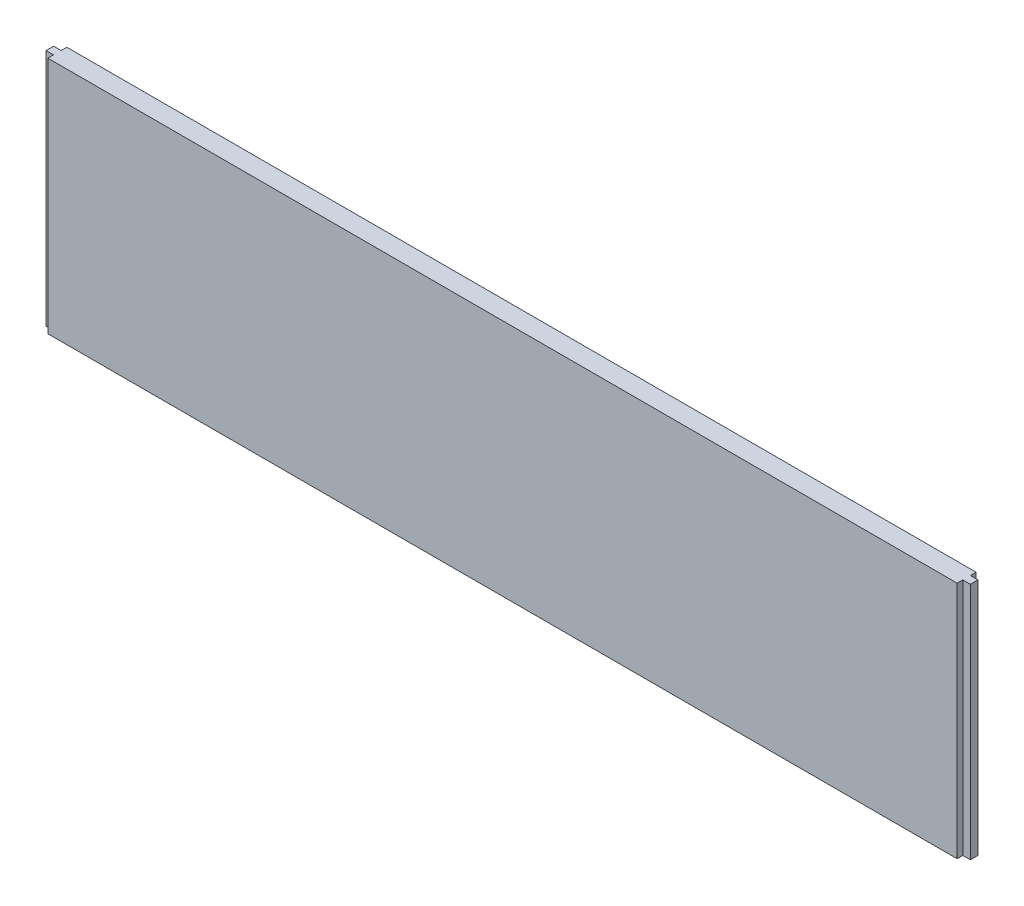
ISO-10303-21;
HEADER;
FILE_DESCRIPTION(('STEP AP214'),'2;1');
FILE_NAME('part.step','',(''),(''),'','','');
FILE_SCHEMA(('AUTOMOTIVE_DESIGN { 1 0 10303 214 1 1 1 1 }'));
ENDSEC;
DATA;
#1=APPLICATION_CONTEXT('core data for automotive mechanical design processes');
#2=APPLICATION_PROTOCOL_DEFINITION('international standard','automotive_design',2000,#1);
#3=PRODUCT_CONTEXT('',#1,'mechanical');
#4=PRODUCT('Part','Part','',(#3));
#5=PRODUCT_RELATED_PRODUCT_CATEGORY('part','',(#4));
#6=PRODUCT_DEFINITION_FORMATION('','',#4);
#7=PRODUCT_DEFINITION_CONTEXT('part definition',#1,'design');
#8=PRODUCT_DEFINITION('design','',#6,#7);
#9=PRODUCT_DEFINITION_SHAPE('','',#8);
#10=(LENGTH_UNIT() NAMED_UNIT(*) SI_UNIT(.MILLI.,.METRE.));
#11=(NAMED_UNIT(*) PLANE_ANGLE_UNIT() SI_UNIT($,.RADIAN.));
#12=(NAMED_UNIT(*) SI_UNIT($,.STERADIAN.) SOLID_ANGLE_UNIT());
#13=UNCERTAINTY_MEASURE_WITH_UNIT(LENGTH_MEASURE(1.E-05),#10,'distance_accuracy_value','');
#14=(GEOMETRIC_REPRESENTATION_CONTEXT(3) GLOBAL_UNCERTAINTY_ASSIGNED_CONTEXT((#13)) GLOBAL_UNIT_ASSIGNED_CONTEXT((#10,
#11,#12)) REPRESENTATION_CONTEXT('',''));
#15=CARTESIAN_POINT('',(0.,0.,0.));
#16=DIRECTION('',(0.,0.,1.));
#17=DIRECTION('',(1.,0.,0.));
#18=AXIS2_PLACEMENT_3D('',#15,#16,#17);
#19=CARTESIAN_POINT('',(0.,0.,15.875));
#20=DIRECTION('',(1.,0.,0.));
#21=DIRECTION('',(0.,0.,-1.));
#22=AXIS2_PLACEMENT_3D('',#19,#20,#21);
#23=PLANE('',#22);
#24=DIRECTION('',(0.,0.,-1.));
#25=VECTOR('',#24,1.);
#26=CARTESIAN_POINT('',(0.,0.,15.875));
#27=LINE('',#26,#25);
#28=CARTESIAN_POINT('',(0.,0.,11.1125));
#29=VERTEX_POINT('',#28);
#30=CARTESIAN_POINT('',(0.,0.,4.7625));
#31=VERTEX_POINT('',#30);
#32=EDGE_CURVE('E11',#29,#31,#27,.T.);
#33=ORIENTED_EDGE('',*,*,#32,.F.);
#34=DIRECTION('',(0.,1.,0.));
#35=VECTOR('',#34,1.);
#36=CARTESIAN_POINT('',(0.,0.,11.1125));
#37=LINE('',#36,#35);
#38=CARTESIAN_POINT('',(0.,200.025,11.1125));
#39=VERTEX_POINT('',#38);
#40=EDGE_CURVE('E125',#29,#39,#37,.T.);
#41=ORIENTED_EDGE('',*,*,#40,.T.);
#42=DIRECTION('',(0.,0.,-1.));
#43=VECTOR('',#42,1.);
#44=CARTESIAN_POINT('',(0.,200.025,15.875));
#45=LINE('',#44,#43);
#46=CARTESIAN_POINT('',(0.,200.025,4.7625));
#47=VERTEX_POINT('',#46);
#48=EDGE_CURVE('E204',#39,#47,#45,.T.);
#49=ORIENTED_EDGE('',*,*,#48,.T.);
#50=DIRECTION('',(0.,1.,0.));
#51=VECTOR('',#50,1.);
#52=CARTESIAN_POINT('',(0.,0.,4.7625));
#53=LINE('',#52,#51);
#54=EDGE_CURVE('E153',#31,#47,#53,.T.);
#55=ORIENTED_EDGE('',*,*,#54,.F.);
#56=EDGE_LOOP('',(#33,#41,#49,#55));
#57=FACE_BOUND('',#56,.T.);
#58=ADVANCED_FACE('F33',(#57),#23,.F.);
#59=CARTESIAN_POINT('',(0.,0.,15.875));
#60=DIRECTION('',(0.,1.,0.));
#61=DIRECTION('',(0.,0.,1.));
#62=AXIS2_PLACEMENT_3D('',#59,#60,#61);
#63=PLANE('',#62);
#64=DIRECTION('',(0.,0.,-1.));
#65=VECTOR('',#64,1.);
#66=CARTESIAN_POINT('',(6.34999999999997,0.,15.875));
#67=LINE('',#66,#65);
#68=CARTESIAN_POINT('',(6.34999999999997,0.,15.875));
#69=VERTEX_POINT('',#68);
#70=CARTESIAN_POINT('',(6.34999999999997,0.,11.1125));
#71=VERTEX_POINT('',#70);
#72=EDGE_CURVE('E47',#69,#71,#67,.T.);
#73=ORIENTED_EDGE('',*,*,#72,.T.);
#74=DIRECTION('',(-1.,0.,0.));
#75=VECTOR('',#74,1.);
#76=CARTESIAN_POINT('',(0.,0.,11.1125));
#77=LINE('',#76,#75);
#78=EDGE_CURVE('E129',#71,#29,#77,.T.);
#79=ORIENTED_EDGE('',*,*,#78,.T.);
#80=ORIENTED_EDGE('',*,*,#32,.T.);
#81=DIRECTION('',(1.,0.,0.));
#82=VECTOR('',#81,1.);
#83=CARTESIAN_POINT('',(0.,0.,4.7625));
#84=LINE('',#83,#82);
#85=CARTESIAN_POINT('',(6.34999999999997,0.,4.7625));
#86=VERTEX_POINT('',#85);
#87=EDGE_CURVE('E147',#31,#86,#84,.T.);
#88=ORIENTED_EDGE('',*,*,#87,.T.);
#89=DIRECTION('',(0.,0.,-1.));
#90=VECTOR('',#89,1.);
#91=CARTESIAN_POINT('',(6.34999999999986,0.,2.67147415300428E-12));
#92=LINE('',#91,#90);
#93=CARTESIAN_POINT('',(6.34999999999986,0.,2.67147415300428E-12));
#94=VERTEX_POINT('',#93);
#95=EDGE_CURVE('E150',#86,#94,#92,.T.);
#96=ORIENTED_EDGE('',*,*,#95,.T.);
#97=DIRECTION('',(1.,0.,0.));
#98=VECTOR('',#97,1.);
#99=CARTESIAN_POINT('',(0.,0.,0.));
#100=LINE('',#99,#98);
#101=CARTESIAN_POINT('',(768.35,0.,0.));
#102=VERTEX_POINT('',#101);
#103=EDGE_CURVE('E195',#94,#102,#100,.T.);
#104=ORIENTED_EDGE('',*,*,#103,.T.);
#105=DIRECTION('',(0.,0.,1.));
#106=VECTOR('',#105,1.);
#107=CARTESIAN_POINT('',(768.35,0.,0.));
#108=LINE('',#107,#106);
#109=CARTESIAN_POINT('',(768.35,0.,4.7625));
#110=VERTEX_POINT('',#109);
#111=EDGE_CURVE('E164',#102,#110,#108,.T.);
#112=ORIENTED_EDGE('',*,*,#111,.T.);
#113=DIRECTION('',(1.,0.,0.));
#114=VECTOR('',#113,1.);
#115=CARTESIAN_POINT('',(774.7,0.,4.7625));
#116=LINE('',#115,#114);
#117=CARTESIAN_POINT('',(774.7,0.,4.7625));
#118=VERTEX_POINT('',#117);
#119=EDGE_CURVE('E167',#110,#118,#116,.T.);
#120=ORIENTED_EDGE('',*,*,#119,.T.);
#121=DIRECTION('',(0.,0.,-1.));
#122=VECTOR('',#121,1.);
#123=CARTESIAN_POINT('',(774.7,0.,15.875));
#124=LINE('',#123,#122);
#125=CARTESIAN_POINT('',(774.7,0.,11.1125));
#126=VERTEX_POINT('',#125);
#127=EDGE_CURVE('E40',#126,#118,#124,.T.);
#128=ORIENTED_EDGE('',*,*,#127,.F.);
#129=DIRECTION('',(-1.,0.,0.));
#130=VECTOR('',#129,1.);
#131=CARTESIAN_POINT('',(774.7,0.,11.1125));
#132=LINE('',#131,#130);
#133=CARTESIAN_POINT('',(768.35,0.,11.1125));
#134=VERTEX_POINT('',#133);
#135=EDGE_CURVE('E182',#126,#134,#132,.T.);
#136=ORIENTED_EDGE('',*,*,#135,.T.);
#137=DIRECTION('',(0.,0.,1.));
#138=VECTOR('',#137,1.);
#139=CARTESIAN_POINT('',(768.35,0.,15.875));
#140=LINE('',#139,#138);
#141=CARTESIAN_POINT('',(768.35,0.,15.875));
#142=VERTEX_POINT('',#141);
#143=EDGE_CURVE('E185',#134,#142,#140,.T.);
#144=ORIENTED_EDGE('',*,*,#143,.T.);
#145=DIRECTION('',(1.,0.,0.));
#146=VECTOR('',#145,1.);
#147=CARTESIAN_POINT('',(0.,0.,15.875));
#148=LINE('',#147,#146);
#149=EDGE_CURVE('E138',#69,#142,#148,.T.);
#150=ORIENTED_EDGE('',*,*,#149,.F.);
#151=EDGE_LOOP('',(#73,#79,#80,#88,#96,#104,#112,#120,#128,#136,#144,#150));
#152=FACE_BOUND('',#151,.T.);
#153=ADVANCED_FACE('F136',(#152),#63,.F.);
#154=CARTESIAN_POINT('',(774.7,0.,15.875));
#155=DIRECTION('',(-1.,0.,0.));
#156=DIRECTION('',(0.,0.,1.));
#157=AXIS2_PLACEMENT_3D('',#154,#155,#156);
#158=PLANE('',#157);
#159=ORIENTED_EDGE('',*,*,#127,.T.);
#160=DIRECTION('',(0.,1.,0.));
#161=VECTOR('',#160,1.);
#162=CARTESIAN_POINT('',(774.7,0.,4.7625));
#163=LINE('',#162,#161);
#164=CARTESIAN_POINT('',(774.7,200.025,4.7625));
#165=VERTEX_POINT('',#164);
#166=EDGE_CURVE('E175',#118,#165,#163,.T.);
#167=ORIENTED_EDGE('',*,*,#166,.T.);
#168=DIRECTION('',(0.,0.,-1.));
#169=VECTOR('',#168,1.);
#170=CARTESIAN_POINT('',(774.7,200.025,15.875));
#171=LINE('',#170,#169);
#172=CARTESIAN_POINT('',(774.7,200.025,11.1125));
#173=VERTEX_POINT('',#172);
#174=EDGE_CURVE('E209',#173,#165,#171,.T.);
#175=ORIENTED_EDGE('',*,*,#174,.F.);
#176=DIRECTION('',(0.,1.,0.));
#177=VECTOR('',#176,1.);
#178=CARTESIAN_POINT('',(774.7,0.,11.1125));
#179=LINE('',#178,#177);
#180=EDGE_CURVE('E188',#126,#173,#179,.T.);
#181=ORIENTED_EDGE('',*,*,#180,.F.);
#182=EDGE_LOOP('',(#159,#167,#175,#181));
#183=FACE_BOUND('',#182,.T.);
#184=ADVANCED_FACE('F215',(#183),#158,.F.);
#185=CARTESIAN_POINT('',(0.,200.025,15.875));
#186=DIRECTION('',(0.,-1.,0.));
#187=DIRECTION('',(0.,0.,-1.));
#188=AXIS2_PLACEMENT_3D('',#185,#186,#187);
#189=PLANE('',#188);
#190=ORIENTED_EDGE('',*,*,#48,.F.);
#191=DIRECTION('',(-1.,0.,0.));
#192=VECTOR('',#191,1.);
#193=CARTESIAN_POINT('',(0.,200.025,11.1125));
#194=LINE('',#193,#192);
#195=CARTESIAN_POINT('',(6.34999999999997,200.025,11.1125));
#196=VERTEX_POINT('',#195);
#197=EDGE_CURVE('E139',#196,#39,#194,.T.);
#198=ORIENTED_EDGE('',*,*,#197,.F.);
#199=DIRECTION('',(0.,0.,-1.));
#200=VECTOR('',#199,1.);
#201=CARTESIAN_POINT('',(6.34999999999997,200.025,15.875));
#202=LINE('',#201,#200);
#203=CARTESIAN_POINT('',(6.34999999999997,200.025,15.875));
#204=VERTEX_POINT('',#203);
#205=EDGE_CURVE('E122',#204,#196,#202,.T.);
#206=ORIENTED_EDGE('',*,*,#205,.F.);
#207=DIRECTION('',(-1.,0.,0.));
#208=VECTOR('',#207,1.);
#209=CARTESIAN_POINT('',(0.,200.025,15.875));
#210=LINE('',#209,#208);
#211=CARTESIAN_POINT('',(768.35,200.025,15.875));
#212=VERTEX_POINT('',#211);
#213=EDGE_CURVE('E200',#212,#204,#210,.T.);
#214=ORIENTED_EDGE('',*,*,#213,.F.);
#215=DIRECTION('',(0.,0.,1.));
#216=VECTOR('',#215,1.);
#217=CARTESIAN_POINT('',(768.35,200.025,15.875));
#218=LINE('',#217,#216);
#219=CARTESIAN_POINT('',(768.35,200.025,11.1125));
#220=VERTEX_POINT('',#219);
#221=EDGE_CURVE('E186',#220,#212,#218,.T.);
#222=ORIENTED_EDGE('',*,*,#221,.F.);
#223=DIRECTION('',(-1.,0.,0.));
#224=VECTOR('',#223,1.);
#225=CARTESIAN_POINT('',(774.7,200.025,11.1125));
#226=LINE('',#225,#224);
#227=EDGE_CURVE('E178',#173,#220,#226,.T.);
#228=ORIENTED_EDGE('',*,*,#227,.F.);
#229=ORIENTED_EDGE('',*,*,#174,.T.);
#230=DIRECTION('',(1.,0.,0.));
#231=VECTOR('',#230,1.);
#232=CARTESIAN_POINT('',(774.7,200.025,4.7625));
#233=LINE('',#232,#231);
#234=CARTESIAN_POINT('',(768.35,200.025,4.7625));
#235=VERTEX_POINT('',#234);
#236=EDGE_CURVE('E168',#235,#165,#233,.T.);
#237=ORIENTED_EDGE('',*,*,#236,.F.);
#238=DIRECTION('',(0.,0.,1.));
#239=VECTOR('',#238,1.);
#240=CARTESIAN_POINT('',(768.35,200.025,0.));
#241=LINE('',#240,#239);
#242=CARTESIAN_POINT('',(768.35,200.025,0.));
#243=VERTEX_POINT('',#242);
#244=EDGE_CURVE('E159',#243,#235,#241,.T.);
#245=ORIENTED_EDGE('',*,*,#244,.F.);
#246=DIRECTION('',(-1.,0.,0.));
#247=VECTOR('',#246,1.);
#248=CARTESIAN_POINT('',(0.,200.025,0.));
#249=LINE('',#248,#247);
#250=CARTESIAN_POINT('',(6.34999999999997,200.025,0.));
#251=VERTEX_POINT('',#250);
#252=EDGE_CURVE('E201',#243,#251,#249,.T.);
#253=ORIENTED_EDGE('',*,*,#252,.T.);
#254=DIRECTION('',(0.,0.,-1.));
#255=VECTOR('',#254,1.);
#256=CARTESIAN_POINT('',(6.34999999999986,200.025,2.67147415300428E-12));
#257=LINE('',#256,#255);
#258=CARTESIAN_POINT('',(6.34999999999997,200.025,4.7625));
#259=VERTEX_POINT('',#258);
#260=EDGE_CURVE('E55',#259,#251,#257,.T.);
#261=ORIENTED_EDGE('',*,*,#260,.F.);
#262=DIRECTION('',(1.,0.,0.));
#263=VECTOR('',#262,1.);
#264=CARTESIAN_POINT('',(0.,200.025,4.7625));
#265=LINE('',#264,#263);
#266=EDGE_CURVE('E144',#47,#259,#265,.T.);
#267=ORIENTED_EDGE('',*,*,#266,.F.);
#268=EDGE_LOOP('',(#190,#198,#206,#214,#222,#228,#229,#237,#245,#253,#261,#267));
#269=FACE_BOUND('',#268,.T.);
#270=ADVANCED_FACE('F225',(#269),#189,.F.);
#271=CARTESIAN_POINT('',(0.,0.,15.875));
#272=DIRECTION('',(0.,0.,-1.));
#273=DIRECTION('',(-1.,0.,0.));
#274=AXIS2_PLACEMENT_3D('',#271,#272,#273);
#275=PLANE('',#274);
#276=ORIENTED_EDGE('',*,*,#213,.T.);
#277=DIRECTION('',(0.,1.,0.));
#278=VECTOR('',#277,1.);
#279=CARTESIAN_POINT('',(6.34999999999997,0.,15.875));
#280=LINE('',#279,#278);
#281=EDGE_CURVE('E126',#69,#204,#280,.T.);
#282=ORIENTED_EDGE('',*,*,#281,.F.);
#283=ORIENTED_EDGE('',*,*,#149,.T.);
#284=DIRECTION('',(0.,1.,0.));
#285=VECTOR('',#284,1.);
#286=CARTESIAN_POINT('',(768.35,0.,15.875));
#287=LINE('',#286,#285);
#288=EDGE_CURVE('E192',#142,#212,#287,.T.);
#289=ORIENTED_EDGE('',*,*,#288,.T.);
#290=EDGE_LOOP('',(#276,#282,#283,#289));
#291=FACE_BOUND('',#290,.T.);
#292=ADVANCED_FACE('F237',(#291),#275,.F.);
#293=CARTESIAN_POINT('',(0.,0.,0.));
#294=DIRECTION('',(0.,0.,-1.));
#295=DIRECTION('',(-1.,0.,0.));
#296=AXIS2_PLACEMENT_3D('',#293,#294,#295);
#297=PLANE('',#296);
#298=DIRECTION('',(0.,1.,0.));
#299=VECTOR('',#298,1.);
#300=CARTESIAN_POINT('',(6.34999999999986,0.,2.67147415300428E-12));
#301=LINE('',#300,#299);
#302=EDGE_CURVE('E157',#94,#251,#301,.T.);
#303=ORIENTED_EDGE('',*,*,#302,.T.);
#304=ORIENTED_EDGE('',*,*,#252,.F.);
#305=DIRECTION('',(0.,1.,0.));
#306=VECTOR('',#305,1.);
#307=CARTESIAN_POINT('',(768.35,0.,0.));
#308=LINE('',#307,#306);
#309=EDGE_CURVE('E171',#102,#243,#308,.T.);
#310=ORIENTED_EDGE('',*,*,#309,.F.);
#311=ORIENTED_EDGE('',*,*,#103,.F.);
#312=EDGE_LOOP('',(#303,#304,#310,#311));
#313=FACE_BOUND('',#312,.T.);
#314=ADVANCED_FACE('F249',(#313),#297,.T.);
#315=CARTESIAN_POINT('',(768.35,0.,15.875));
#316=DIRECTION('',(-1.,0.,0.));
#317=DIRECTION('',(0.,0.,1.));
#318=AXIS2_PLACEMENT_3D('',#315,#316,#317);
#319=PLANE('',#318);
#320=ORIENTED_EDGE('',*,*,#221,.T.);
#321=ORIENTED_EDGE('',*,*,#288,.F.);
#322=ORIENTED_EDGE('',*,*,#143,.F.);
#323=DIRECTION('',(0.,1.,0.));
#324=VECTOR('',#323,1.);
#325=CARTESIAN_POINT('',(768.35,0.,11.1125));
#326=LINE('',#325,#324);
#327=EDGE_CURVE('E196',#134,#220,#326,.T.);
#328=ORIENTED_EDGE('',*,*,#327,.T.);
#329=EDGE_LOOP('',(#320,#321,#322,#328));
#330=FACE_BOUND('',#329,.T.);
#331=ADVANCED_FACE('F235',(#330),#319,.F.);
#332=CARTESIAN_POINT('',(774.7,0.,11.1125));
#333=DIRECTION('',(0.,0.,-1.));
#334=DIRECTION('',(-1.,0.,0.));
#335=AXIS2_PLACEMENT_3D('',#332,#333,#334);
#336=PLANE('',#335);
#337=ORIENTED_EDGE('',*,*,#227,.T.);
#338=ORIENTED_EDGE('',*,*,#327,.F.);
#339=ORIENTED_EDGE('',*,*,#135,.F.);
#340=ORIENTED_EDGE('',*,*,#180,.T.);
#341=EDGE_LOOP('',(#337,#338,#339,#340));
#342=FACE_BOUND('',#341,.T.);
#343=ADVANCED_FACE('F231',(#342),#336,.F.);
#344=CARTESIAN_POINT('',(774.7,0.,4.7625));
#345=DIRECTION('',(0.,0.,1.));
#346=DIRECTION('',(1.,0.,0.));
#347=AXIS2_PLACEMENT_3D('',#344,#345,#346);
#348=PLANE('',#347);
#349=ORIENTED_EDGE('',*,*,#236,.T.);
#350=ORIENTED_EDGE('',*,*,#166,.F.);
#351=ORIENTED_EDGE('',*,*,#119,.F.);
#352=DIRECTION('',(0.,1.,0.));
#353=VECTOR('',#352,1.);
#354=CARTESIAN_POINT('',(768.35,0.,4.7625));
#355=LINE('',#354,#353);
#356=EDGE_CURVE('E179',#110,#235,#355,.T.);
#357=ORIENTED_EDGE('',*,*,#356,.T.);
#358=EDGE_LOOP('',(#349,#350,#351,#357));
#359=FACE_BOUND('',#358,.T.);
#360=ADVANCED_FACE('F220',(#359),#348,.F.);
#361=CARTESIAN_POINT('',(768.35,0.,0.));
#362=DIRECTION('',(-1.,0.,0.));
#363=DIRECTION('',(0.,0.,1.));
#364=AXIS2_PLACEMENT_3D('',#361,#362,#363);
#365=PLANE('',#364);
#366=ORIENTED_EDGE('',*,*,#244,.T.);
#367=ORIENTED_EDGE('',*,*,#356,.F.);
#368=ORIENTED_EDGE('',*,*,#111,.F.);
#369=ORIENTED_EDGE('',*,*,#309,.T.);
#370=EDGE_LOOP('',(#366,#367,#368,#369));
#371=FACE_BOUND('',#370,.T.);
#372=ADVANCED_FACE('F251',(#371),#365,.F.);
#373=CARTESIAN_POINT('',(6.34999999999986,0.,2.67147415300428E-12));
#374=DIRECTION('',(1.,0.,0.));
#375=DIRECTION('',(0.,0.,-1.));
#376=AXIS2_PLACEMENT_3D('',#373,#374,#375);
#377=PLANE('',#376);
#378=ORIENTED_EDGE('',*,*,#260,.T.);
#379=ORIENTED_EDGE('',*,*,#302,.F.);
#380=ORIENTED_EDGE('',*,*,#95,.F.);
#381=DIRECTION('',(0.,1.,0.));
#382=VECTOR('',#381,1.);
#383=CARTESIAN_POINT('',(6.34999999999997,0.,4.7625));
#384=LINE('',#383,#382);
#385=EDGE_CURVE('E160',#86,#259,#384,.T.);
#386=ORIENTED_EDGE('',*,*,#385,.T.);
#387=EDGE_LOOP('',(#378,#379,#380,#386));
#388=FACE_BOUND('',#387,.T.);
#389=ADVANCED_FACE('F245',(#388),#377,.F.);
#390=CARTESIAN_POINT('',(0.,0.,4.7625));
#391=DIRECTION('',(0.,0.,1.));
#392=DIRECTION('',(1.,0.,0.));
#393=AXIS2_PLACEMENT_3D('',#390,#391,#392);
#394=PLANE('',#393);
#395=ORIENTED_EDGE('',*,*,#266,.T.);
#396=ORIENTED_EDGE('',*,*,#385,.F.);
#397=ORIENTED_EDGE('',*,*,#87,.F.);
#398=ORIENTED_EDGE('',*,*,#54,.T.);
#399=EDGE_LOOP('',(#395,#396,#397,#398));
#400=FACE_BOUND('',#399,.T.);
#401=ADVANCED_FACE('F243',(#400),#394,.F.);
#402=CARTESIAN_POINT('',(0.,0.,11.1125));
#403=DIRECTION('',(0.,0.,-1.));
#404=DIRECTION('',(-1.,0.,0.));
#405=AXIS2_PLACEMENT_3D('',#402,#403,#404);
#406=PLANE('',#405);
#407=ORIENTED_EDGE('',*,*,#197,.T.);
#408=ORIENTED_EDGE('',*,*,#40,.F.);
#409=ORIENTED_EDGE('',*,*,#78,.F.);
#410=DIRECTION('',(0.,1.,0.));
#411=VECTOR('',#410,1.);
#412=CARTESIAN_POINT('',(6.34999999999997,0.,11.1125));
#413=LINE('',#412,#411);
#414=EDGE_CURVE('E118',#71,#196,#413,.T.);
#415=ORIENTED_EDGE('',*,*,#414,.T.);
#416=EDGE_LOOP('',(#407,#408,#409,#415));
#417=FACE_BOUND('',#416,.T.);
#418=ADVANCED_FACE('F130',(#417),#406,.F.);
#419=CARTESIAN_POINT('',(6.34999999999997,0.,15.875));
#420=DIRECTION('',(1.,0.,0.));
#421=DIRECTION('',(0.,0.,-1.));
#422=AXIS2_PLACEMENT_3D('',#419,#420,#421);
#423=PLANE('',#422);
#424=ORIENTED_EDGE('',*,*,#205,.T.);
#425=ORIENTED_EDGE('',*,*,#414,.F.);
#426=ORIENTED_EDGE('',*,*,#72,.F.);
#427=ORIENTED_EDGE('',*,*,#281,.T.);
#428=EDGE_LOOP('',(#424,#425,#426,#427));
#429=FACE_BOUND('',#428,.T.);
#430=ADVANCED_FACE('F120',(#429),#423,.F.);
#431=CLOSED_SHELL('',(#58,#153,#184,#270,#292,#314,#331,#343,#360,#372,#389,#401,#418,#430));
#432=MANIFOLD_SOLID_BREP('B2',#431);
#433=ADVANCED_BREP_SHAPE_REPRESENTATION('',(#18,#432),#14);
#434=SHAPE_DEFINITION_REPRESENTATION(#9,#433);
ENDSEC;
END-ISO-10303-21;
